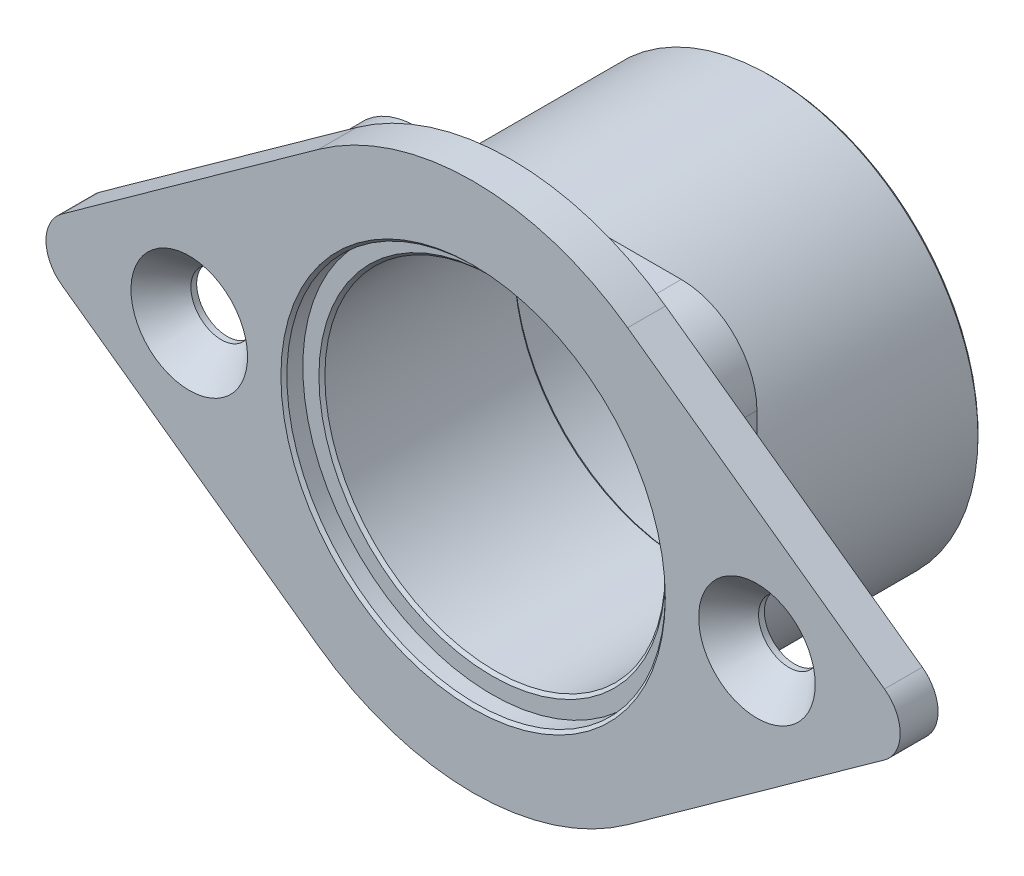
ISO-10303-21;
HEADER;
FILE_DESCRIPTION(('STEP AP214'),'2;1');
FILE_NAME('part.step','',(''),(''),'','','');
FILE_SCHEMA(('AUTOMOTIVE_DESIGN { 1 0 10303 214 1 1 1 1 }'));
ENDSEC;
DATA;
#1=APPLICATION_CONTEXT('core data for automotive mechanical design processes');
#2=APPLICATION_PROTOCOL_DEFINITION('international standard','automotive_design',2000,#1);
#3=PRODUCT_CONTEXT('',#1,'mechanical');
#4=PRODUCT('Part','Part','',(#3));
#5=PRODUCT_RELATED_PRODUCT_CATEGORY('part','',(#4));
#6=PRODUCT_DEFINITION_FORMATION('','',#4);
#7=PRODUCT_DEFINITION_CONTEXT('part definition',#1,'design');
#8=PRODUCT_DEFINITION('design','',#6,#7);
#9=PRODUCT_DEFINITION_SHAPE('','',#8);
#10=(LENGTH_UNIT() NAMED_UNIT(*) SI_UNIT(.MILLI.,.METRE.));
#11=(NAMED_UNIT(*) PLANE_ANGLE_UNIT() SI_UNIT($,.RADIAN.));
#12=(NAMED_UNIT(*) SI_UNIT($,.STERADIAN.) SOLID_ANGLE_UNIT());
#13=UNCERTAINTY_MEASURE_WITH_UNIT(LENGTH_MEASURE(1.E-05),#10,'distance_accuracy_value','');
#14=(GEOMETRIC_REPRESENTATION_CONTEXT(3) GLOBAL_UNCERTAINTY_ASSIGNED_CONTEXT((#13)) GLOBAL_UNIT_ASSIGNED_CONTEXT((#10,
#11,#12)) REPRESENTATION_CONTEXT('',''));
#15=CARTESIAN_POINT('',(0.,0.,0.));
#16=DIRECTION('',(0.,0.,1.));
#17=DIRECTION('',(1.,0.,0.));
#18=AXIS2_PLACEMENT_3D('',#15,#16,#17);
#19=CARTESIAN_POINT('',(0.,0.,0.));
#20=DIRECTION('',(0.,0.,1.));
#21=DIRECTION('',(1.,0.,0.));
#22=AXIS2_PLACEMENT_3D('',#19,#20,#21);
#23=CONICAL_SURFACE('',#22,14.5248,0.785398163397445);
#24=CARTESIAN_POINT('',(0.,0.,-0.249999999999999));
#25=DIRECTION('',(0.,0.,-1.));
#26=DIRECTION('',(-1.,0.,0.));
#27=AXIS2_PLACEMENT_3D('',#24,#25,#26);
#28=CIRCLE('',#27,14.2748);
#29=CARTESIAN_POINT('',(-14.2748,0.,-0.249999999999999));
#30=VERTEX_POINT('',#29);
#31=EDGE_CURVE('E184',#30,#30,#28,.T.);
#32=ORIENTED_EDGE('',*,*,#31,.T.);
#33=EDGE_LOOP('',(#32));
#34=FACE_BOUND('',#33,.T.);
#35=CARTESIAN_POINT('',(0.,0.,0.));
#36=DIRECTION('',(0.,0.,1.));
#37=DIRECTION('',(1.,0.,0.));
#38=AXIS2_PLACEMENT_3D('',#35,#36,#37);
#39=CIRCLE('',#38,14.5248);
#40=CARTESIAN_POINT('',(14.5248,0.,0.));
#41=VERTEX_POINT('',#40);
#42=EDGE_CURVE('E19',#41,#41,#39,.F.);
#43=ORIENTED_EDGE('',*,*,#42,.F.);
#44=EDGE_LOOP('',(#43));
#45=FACE_BOUND('',#44,.T.);
#46=ADVANCED_FACE('F16',(#34,#45),#23,.F.);
#47=CARTESIAN_POINT('',(0.,0.,0.));
#48=DIRECTION('',(0.,0.,1.));
#49=DIRECTION('',(1.,0.,0.));
#50=AXIS2_PLACEMENT_3D('',#47,#48,#49);
#51=PLANE('',#50);
#52=CARTESIAN_POINT('',(0.,0.,0.));
#53=DIRECTION('',(0.,0.,1.));
#54=DIRECTION('',(1.,0.,0.));
#55=AXIS2_PLACEMENT_3D('',#52,#53,#54);
#56=CIRCLE('',#55,15.875);
#57=CARTESIAN_POINT('',(15.875,0.,0.));
#58=VERTEX_POINT('',#57);
#59=EDGE_CURVE('E183',#58,#58,#56,.T.);
#60=ORIENTED_EDGE('',*,*,#59,.T.);
#61=EDGE_LOOP('',(#60));
#62=FACE_BOUND('',#61,.T.);
#63=ORIENTED_EDGE('',*,*,#42,.T.);
#64=EDGE_LOOP('',(#63));
#65=FACE_BOUND('',#64,.T.);
#66=ADVANCED_FACE('F278',(#62,#65),#51,.T.);
#67=CARTESIAN_POINT('',(0.,0.,1.5875));
#68=DIRECTION('',(0.,0.,-1.));
#69=DIRECTION('',(-1.,0.,0.));
#70=AXIS2_PLACEMENT_3D('',#67,#68,#69);
#71=CYLINDRICAL_SURFACE('',#70,14.2748);
#72=ORIENTED_EDGE('',*,*,#31,.F.);
#73=EDGE_LOOP('',(#72));
#74=FACE_BOUND('',#73,.T.);
#75=CARTESIAN_POINT('',(0.,0.,-16.16475));
#76=DIRECTION('',(0.,0.,-1.));
#77=DIRECTION('',(-1.,0.,0.));
#78=AXIS2_PLACEMENT_3D('',#75,#76,#77);
#79=CIRCLE('',#78,14.2748);
#80=CARTESIAN_POINT('',(-14.2748,0.,-16.16475));
#81=VERTEX_POINT('',#80);
#82=EDGE_CURVE('E180',#81,#81,#79,.T.);
#83=ORIENTED_EDGE('',*,*,#82,.T.);
#84=EDGE_LOOP('',(#83));
#85=FACE_BOUND('',#84,.T.);
#86=ADVANCED_FACE('F285',(#74,#85),#71,.F.);
#87=CARTESIAN_POINT('',(0.,0.,0.));
#88=DIRECTION('',(0.,0.,1.));
#89=DIRECTION('',(1.,0.,0.));
#90=AXIS2_PLACEMENT_3D('',#87,#88,#89);
#91=CYLINDRICAL_SURFACE('',#90,15.875);
#92=ORIENTED_EDGE('',*,*,#59,.F.);
#93=EDGE_LOOP('',(#92));
#94=FACE_BOUND('',#93,.T.);
#95=CARTESIAN_POINT('',(0.,0.,1.3375));
#96=DIRECTION('',(0.,0.,1.));
#97=DIRECTION('',(1.,0.,0.));
#98=AXIS2_PLACEMENT_3D('',#95,#96,#97);
#99=CIRCLE('',#98,15.875);
#100=CARTESIAN_POINT('',(15.875,0.,1.3375));
#101=VERTEX_POINT('',#100);
#102=EDGE_CURVE('E176',#101,#101,#99,.T.);
#103=ORIENTED_EDGE('',*,*,#102,.T.);
#104=EDGE_LOOP('',(#103));
#105=FACE_BOUND('',#104,.T.);
#106=ADVANCED_FACE('F281',(#94,#105),#91,.F.);
#107=CARTESIAN_POINT('',(0.,0.,-16.41475));
#108=DIRECTION('',(0.,0.,-1.));
#109=DIRECTION('',(-1.,0.,0.));
#110=AXIS2_PLACEMENT_3D('',#107,#108,#109);
#111=CONICAL_SURFACE('',#110,14.5248,0.785398163397452);
#112=ORIENTED_EDGE('',*,*,#82,.F.);
#113=EDGE_LOOP('',(#112));
#114=FACE_BOUND('',#113,.T.);
#115=CARTESIAN_POINT('',(0.,0.,-16.41475));
#116=DIRECTION('',(0.,0.,-1.));
#117=DIRECTION('',(-1.,0.,0.));
#118=AXIS2_PLACEMENT_3D('',#115,#116,#117);
#119=CIRCLE('',#118,14.5248);
#120=CARTESIAN_POINT('',(-14.5248,0.,-16.41475));
#121=VERTEX_POINT('',#120);
#122=EDGE_CURVE('E179',#121,#121,#119,.F.);
#123=ORIENTED_EDGE('',*,*,#122,.F.);
#124=EDGE_LOOP('',(#123));
#125=FACE_BOUND('',#124,.T.);
#126=ADVANCED_FACE('F284',(#114,#125),#111,.F.);
#127=CARTESIAN_POINT('',(0.,0.,1.5875));
#128=DIRECTION('',(0.,0.,1.));
#129=DIRECTION('',(1.,0.,0.));
#130=AXIS2_PLACEMENT_3D('',#127,#128,#129);
#131=CONICAL_SURFACE('',#130,16.125,0.785398163397434);
#132=ORIENTED_EDGE('',*,*,#102,.F.);
#133=EDGE_LOOP('',(#132));
#134=FACE_BOUND('',#133,.T.);
#135=CARTESIAN_POINT('',(0.,0.,1.5875));
#136=DIRECTION('',(0.,0.,1.));
#137=DIRECTION('',(1.,0.,0.));
#138=AXIS2_PLACEMENT_3D('',#135,#136,#137);
#139=CIRCLE('',#138,16.125);
#140=CARTESIAN_POINT('',(16.125,0.,1.5875));
#141=VERTEX_POINT('',#140);
#142=EDGE_CURVE('E271',#141,#141,#139,.F.);
#143=ORIENTED_EDGE('',*,*,#142,.F.);
#144=EDGE_LOOP('',(#143));
#145=FACE_BOUND('',#144,.T.);
#146=ADVANCED_FACE('F289',(#134,#145),#131,.F.);
#147=CARTESIAN_POINT('',(0.,0.,-16.41475));
#148=DIRECTION('',(0.,0.,-1.));
#149=DIRECTION('',(-1.,0.,0.));
#150=AXIS2_PLACEMENT_3D('',#147,#148,#149);
#151=PLANE('',#150);
#152=CARTESIAN_POINT('',(0.,0.,-16.41475));
#153=DIRECTION('',(0.,0.,-1.));
#154=DIRECTION('',(-1.,0.,0.));
#155=AXIS2_PLACEMENT_3D('',#152,#153,#154);
#156=CIRCLE('',#155,15.86865);
#157=CARTESIAN_POINT('',(-15.86865,0.,-16.41475));
#158=VERTEX_POINT('',#157);
#159=EDGE_CURVE('E175',#158,#158,#156,.T.);
#160=ORIENTED_EDGE('',*,*,#159,.T.);
#161=EDGE_LOOP('',(#160));
#162=FACE_BOUND('',#161,.T.);
#163=ORIENTED_EDGE('',*,*,#122,.T.);
#164=EDGE_LOOP('',(#163));
#165=FACE_BOUND('',#164,.T.);
#166=ADVANCED_FACE('F292',(#162,#165),#151,.T.);
#167=CARTESIAN_POINT('',(-23.8125,0.,1.58749999997099));
#168=DIRECTION('',(0.,0.,1.));
#169=DIRECTION('',(0.,-1.,0.));
#170=AXIS2_PLACEMENT_3D('',#167,#168,#169);
#171=CONICAL_SURFACE('',#170,4.88949999991382,0.715584993310947);
#172=CARTESIAN_POINT('',(-23.8125,0.,-1.10068089399405));
#173=DIRECTION('',(0.,0.,1.));
#174=DIRECTION('',(1.,0.,0.));
#175=AXIS2_PLACEMENT_3D('',#172,#173,#174);
#176=CIRCLE('',#175,2.5527);
#177=CARTESIAN_POINT('',(-21.2598,0.,-1.10068089399405));
#178=VERTEX_POINT('',#177);
#179=EDGE_CURVE('E172',#178,#178,#176,.F.);
#180=ORIENTED_EDGE('',*,*,#179,.T.);
#181=EDGE_LOOP('',(#180));
#182=FACE_BOUND('',#181,.T.);
#183=CARTESIAN_POINT('',(-23.8125,0.,1.58749999997099));
#184=DIRECTION('',(0.,0.,1.));
#185=DIRECTION('',(0.,-1.,0.));
#186=AXIS2_PLACEMENT_3D('',#183,#184,#185);
#187=CIRCLE('',#186,4.88949999991382);
#188=CARTESIAN_POINT('',(-23.8125,-4.88949999991382,1.58749999997099));
#189=VERTEX_POINT('',#188);
#190=EDGE_CURVE('E268',#189,#189,#187,.F.);
#191=ORIENTED_EDGE('',*,*,#190,.F.);
#192=EDGE_LOOP('',(#191));
#193=FACE_BOUND('',#192,.T.);
#194=ADVANCED_FACE('F308',(#182,#193),#171,.F.);
#195=CARTESIAN_POINT('',(23.8125,0.,1.58750000008467));
#196=DIRECTION('',(0.,0.,1.));
#197=DIRECTION('',(1.,0.,0.));
#198=AXIS2_PLACEMENT_3D('',#195,#196,#197);
#199=CONICAL_SURFACE('',#198,4.88950000000978,0.715584993314095);
#200=CARTESIAN_POINT('',(23.8125,0.,-1.10068089399405));
#201=DIRECTION('',(0.,0.,1.));
#202=DIRECTION('',(1.,0.,0.));
#203=AXIS2_PLACEMENT_3D('',#200,#201,#202);
#204=CIRCLE('',#203,2.5527);
#205=CARTESIAN_POINT('',(26.3652,0.,-1.10068089399405));
#206=VERTEX_POINT('',#205);
#207=EDGE_CURVE('E150',#206,#206,#204,.F.);
#208=ORIENTED_EDGE('',*,*,#207,.T.);
#209=EDGE_LOOP('',(#208));
#210=FACE_BOUND('',#209,.T.);
#211=CARTESIAN_POINT('',(23.8125,0.,1.58750000008467));
#212=DIRECTION('',(0.,0.,1.));
#213=DIRECTION('',(1.,0.,0.));
#214=AXIS2_PLACEMENT_3D('',#211,#212,#213);
#215=CIRCLE('',#214,4.88950000000978);
#216=CARTESIAN_POINT('',(28.7020000000098,0.,1.58750000008467));
#217=VERTEX_POINT('',#216);
#218=EDGE_CURVE('E265',#217,#217,#215,.F.);
#219=ORIENTED_EDGE('',*,*,#218,.F.);
#220=EDGE_LOOP('',(#219));
#221=FACE_BOUND('',#220,.T.);
#222=ADVANCED_FACE('F298',(#210,#221),#199,.F.);
#223=CARTESIAN_POINT('',(0.,0.,1.5875));
#224=DIRECTION('',(0.,0.,1.));
#225=DIRECTION('',(1.,0.,0.));
#226=AXIS2_PLACEMENT_3D('',#223,#224,#225);
#227=PLANE('',#226);
#228=DIRECTION('',(-0.812232862067414,0.583333333333333,0.));
#229=VECTOR('',#228,1.);
#230=CARTESIAN_POINT('',(-12.9645833333333,-18.0518753594483,1.5875));
#231=LINE('',#230,#229);
#232=CARTESIAN_POINT('',(-34.5092261904762,-2.57883933706404,1.5875));
#233=VERTEX_POINT('',#232);
#234=CARTESIAN_POINT('',(-12.9645833333333,-18.0518753594483,1.5875));
#235=VERTEX_POINT('',#234);
#236=EDGE_CURVE('E168',#233,#235,#231,.F.);
#237=ORIENTED_EDGE('',*,*,#236,.T.);
#238=CARTESIAN_POINT('',(0.,0.,1.5875));
#239=DIRECTION('',(0.,0.,-1.));
#240=DIRECTION('',(-1.,0.,0.));
#241=AXIS2_PLACEMENT_3D('',#238,#239,#240);
#242=CIRCLE('',#241,22.225);
#243=CARTESIAN_POINT('',(12.9645833333333,-18.0518753594483,1.5875));
#244=VERTEX_POINT('',#243);
#245=EDGE_CURVE('E257',#244,#235,#242,.T.);
#246=ORIENTED_EDGE('',*,*,#245,.F.);
#247=DIRECTION('',(0.812232862067414,0.583333333333333,0.));
#248=VECTOR('',#247,1.);
#249=CARTESIAN_POINT('',(12.9645833333333,-18.0518753594483,1.5875));
#250=LINE('',#249,#248);
#251=CARTESIAN_POINT('',(34.5092261904762,-2.57883933706403,1.5875));
#252=VERTEX_POINT('',#251);
#253=EDGE_CURVE('E686',#252,#244,#250,.F.);
#254=ORIENTED_EDGE('',*,*,#253,.F.);
#255=CARTESIAN_POINT('',(32.6571428571429,0.,1.5875));
#256=DIRECTION('',(0.,0.,-1.));
#257=DIRECTION('',(-1.,0.,0.));
#258=AXIS2_PLACEMENT_3D('',#255,#256,#257);
#259=CIRCLE('',#258,3.175);
#260=CARTESIAN_POINT('',(34.5092261904762,2.57883933706404,1.5875));
#261=VERTEX_POINT('',#260);
#262=EDGE_CURVE('E252',#261,#252,#259,.T.);
#263=ORIENTED_EDGE('',*,*,#262,.F.);
#264=DIRECTION('',(-0.812232862067414,0.583333333333333,0.));
#265=VECTOR('',#264,1.);
#266=CARTESIAN_POINT('',(12.9645833333333,18.0518753594483,1.5875));
#267=LINE('',#266,#265);
#268=CARTESIAN_POINT('',(12.9645833333333,18.0518753594483,1.5875));
#269=VERTEX_POINT('',#268);
#270=EDGE_CURVE('E146',#269,#261,#267,.F.);
#271=ORIENTED_EDGE('',*,*,#270,.F.);
#272=CARTESIAN_POINT('',(0.,0.,1.5875));
#273=DIRECTION('',(0.,0.,-1.));
#274=DIRECTION('',(-1.,0.,0.));
#275=AXIS2_PLACEMENT_3D('',#272,#273,#274);
#276=CIRCLE('',#275,22.225);
#277=CARTESIAN_POINT('',(-12.9645833333333,18.0518753594483,1.5875));
#278=VERTEX_POINT('',#277);
#279=EDGE_CURVE('E138',#278,#269,#276,.T.);
#280=ORIENTED_EDGE('',*,*,#279,.F.);
#281=DIRECTION('',(0.812232862067414,0.583333333333333,0.));
#282=VECTOR('',#281,1.);
#283=CARTESIAN_POINT('',(-12.9645833333333,18.0518753594483,1.5875));
#284=LINE('',#283,#282);
#285=CARTESIAN_POINT('',(-34.5092261904762,2.57883933706403,1.5875));
#286=VERTEX_POINT('',#285);
#287=EDGE_CURVE('E143',#278,#286,#284,.F.);
#288=ORIENTED_EDGE('',*,*,#287,.T.);
#289=CARTESIAN_POINT('',(-32.6571428571429,0.,1.5875));
#290=DIRECTION('',(0.,0.,-1.));
#291=DIRECTION('',(-1.,0.,0.));
#292=AXIS2_PLACEMENT_3D('',#289,#290,#291);
#293=CIRCLE('',#292,3.175);
#294=EDGE_CURVE('E164',#233,#286,#293,.T.);
#295=ORIENTED_EDGE('',*,*,#294,.F.);
#296=EDGE_LOOP('',(#237,#246,#254,#263,#271,#280,#288,#295));
#297=FACE_BOUND('',#296,.T.);
#298=ORIENTED_EDGE('',*,*,#218,.T.);
#299=EDGE_LOOP('',(#298));
#300=FACE_BOUND('',#299,.T.);
#301=ORIENTED_EDGE('',*,*,#190,.T.);
#302=EDGE_LOOP('',(#301));
#303=FACE_BOUND('',#302,.T.);
#304=ORIENTED_EDGE('',*,*,#142,.T.);
#305=EDGE_LOOP('',(#304));
#306=FACE_BOUND('',#305,.T.);
#307=ADVANCED_FACE('F140',(#297,#300,#303,#306),#227,.T.);
#308=CARTESIAN_POINT('',(0.,0.,-16.41475));
#309=DIRECTION('',(0.,0.,-1.));
#310=DIRECTION('',(-1.,0.,0.));
#311=AXIS2_PLACEMENT_3D('',#308,#309,#310);
#312=CYLINDRICAL_SURFACE('',#311,15.86865);
#313=ORIENTED_EDGE('',*,*,#159,.F.);
#314=EDGE_LOOP('',(#313));
#315=FACE_BOUND('',#314,.T.);
#316=CARTESIAN_POINT('',(0.,0.,-23.3085));
#317=DIRECTION('',(0.,0.,-1.));
#318=DIRECTION('',(-1.,0.,0.));
#319=AXIS2_PLACEMENT_3D('',#316,#317,#318);
#320=CIRCLE('',#319,15.86865);
#321=CARTESIAN_POINT('',(-15.86865,0.,-23.3085));
#322=VERTEX_POINT('',#321);
#323=EDGE_CURVE('E251',#322,#322,#320,.T.);
#324=ORIENTED_EDGE('',*,*,#323,.T.);
#325=EDGE_LOOP('',(#324));
#326=FACE_BOUND('',#325,.T.);
#327=ADVANCED_FACE('F297',(#315,#326),#312,.F.);
#328=CARTESIAN_POINT('',(-23.8125,0.,1.5875));
#329=DIRECTION('',(0.,0.,1.));
#330=DIRECTION('',(1.,0.,0.));
#331=AXIS2_PLACEMENT_3D('',#328,#329,#330);
#332=CYLINDRICAL_SURFACE('',#331,2.5527);
#333=CARTESIAN_POINT('',(-23.8125,0.,-1.5875));
#334=DIRECTION('',(0.,0.,1.));
#335=DIRECTION('',(1.,0.,0.));
#336=AXIS2_PLACEMENT_3D('',#333,#334,#335);
#337=CIRCLE('',#336,2.5527);
#338=CARTESIAN_POINT('',(-21.2598,0.,-1.5875));
#339=VERTEX_POINT('',#338);
#340=EDGE_CURVE('E248',#339,#339,#337,.F.);
#341=ORIENTED_EDGE('',*,*,#340,.T.);
#342=EDGE_LOOP('',(#341));
#343=FACE_BOUND('',#342,.T.);
#344=ORIENTED_EDGE('',*,*,#179,.F.);
#345=EDGE_LOOP('',(#344));
#346=FACE_BOUND('',#345,.T.);
#347=ADVANCED_FACE('F305',(#343,#346),#332,.F.);
#348=CARTESIAN_POINT('',(23.8125,0.,1.5875));
#349=DIRECTION('',(0.,0.,1.));
#350=DIRECTION('',(1.,0.,0.));
#351=AXIS2_PLACEMENT_3D('',#348,#349,#350);
#352=CYLINDRICAL_SURFACE('',#351,2.5527);
#353=CARTESIAN_POINT('',(23.8125,0.,-1.5875));
#354=DIRECTION('',(0.,0.,1.));
#355=DIRECTION('',(1.,0.,0.));
#356=AXIS2_PLACEMENT_3D('',#353,#354,#355);
#357=CIRCLE('',#356,2.5527);
#358=CARTESIAN_POINT('',(26.3652,0.,-1.5875));
#359=VERTEX_POINT('',#358);
#360=EDGE_CURVE('E245',#359,#359,#357,.F.);
#361=ORIENTED_EDGE('',*,*,#360,.T.);
#362=EDGE_LOOP('',(#361));
#363=FACE_BOUND('',#362,.T.);
#364=ORIENTED_EDGE('',*,*,#207,.F.);
#365=EDGE_LOOP('',(#364));
#366=FACE_BOUND('',#365,.T.);
#367=ADVANCED_FACE('F410',(#363,#366),#352,.F.);
#368=CARTESIAN_POINT('',(0.,0.,1.5875));
#369=DIRECTION('',(0.,0.,-1.));
#370=DIRECTION('',(-1.,0.,0.));
#371=AXIS2_PLACEMENT_3D('',#368,#369,#370);
#372=CYLINDRICAL_SURFACE('',#371,22.225);
#373=ORIENTED_EDGE('',*,*,#279,.T.);
#374=DIRECTION('',(0.,0.,1.));
#375=VECTOR('',#374,1.);
#376=CARTESIAN_POINT('',(12.9645833333333,18.0518753594483,1.5875));
#377=LINE('',#376,#375);
#378=CARTESIAN_POINT('',(12.9645833333333,18.0518753594483,-1.5875));
#379=VERTEX_POINT('',#378);
#380=EDGE_CURVE('E681',#379,#269,#377,.T.);
#381=ORIENTED_EDGE('',*,*,#380,.F.);
#382=CARTESIAN_POINT('',(0.,0.,-1.5875));
#383=DIRECTION('',(0.,0.,-1.));
#384=DIRECTION('',(-1.,0.,0.));
#385=AXIS2_PLACEMENT_3D('',#382,#383,#384);
#386=CIRCLE('',#385,22.225);
#387=CARTESIAN_POINT('',(-12.9645833333333,18.0518753594483,-1.5875));
#388=VERTEX_POINT('',#387);
#389=EDGE_CURVE('E155',#379,#388,#386,.F.);
#390=ORIENTED_EDGE('',*,*,#389,.T.);
#391=DIRECTION('',(0.,0.,1.));
#392=VECTOR('',#391,1.);
#393=CARTESIAN_POINT('',(-12.9645833333333,18.0518753594483,1.5875));
#394=LINE('',#393,#392);
#395=EDGE_CURVE('E149',#388,#278,#394,.T.);
#396=ORIENTED_EDGE('',*,*,#395,.T.);
#397=EDGE_LOOP('',(#373,#381,#390,#396));
#398=FACE_BOUND('',#397,.T.);
#399=ADVANCED_FACE('F153',(#398),#372,.T.);
#400=CARTESIAN_POINT('',(-12.9645833333333,18.0518753594483,1.5875));
#401=DIRECTION('',(0.583333333333333,-0.812232862067414,0.));
#402=DIRECTION('',(0.812232862067414,0.583333333333333,0.));
#403=AXIS2_PLACEMENT_3D('',#400,#401,#402);
#404=PLANE('',#403);
#405=DIRECTION('',(0.,0.,-1.));
#406=VECTOR('',#405,1.);
#407=CARTESIAN_POINT('',(-34.5092261904762,2.57883933706403,1.5875));
#408=LINE('',#407,#406);
#409=CARTESIAN_POINT('',(-34.5092261904762,2.57883933706403,-1.5875));
#410=VERTEX_POINT('',#409);
#411=EDGE_CURVE('E162',#286,#410,#408,.T.);
#412=ORIENTED_EDGE('',*,*,#411,.F.);
#413=ORIENTED_EDGE('',*,*,#287,.F.);
#414=ORIENTED_EDGE('',*,*,#395,.F.);
#415=DIRECTION('',(-0.812232862067414,-0.583333333333333,0.));
#416=VECTOR('',#415,1.);
#417=CARTESIAN_POINT('',(-12.9645833333333,18.0518753594483,-1.5875));
#418=LINE('',#417,#416);
#419=EDGE_CURVE('E243',#388,#410,#418,.T.);
#420=ORIENTED_EDGE('',*,*,#419,.T.);
#421=EDGE_LOOP('',(#412,#413,#414,#420));
#422=FACE_BOUND('',#421,.T.);
#423=ADVANCED_FACE('F160',(#422),#404,.F.);
#424=CARTESIAN_POINT('',(-32.6571428571429,0.,1.5875));
#425=DIRECTION('',(0.,0.,-1.));
#426=DIRECTION('',(-1.,0.,0.));
#427=AXIS2_PLACEMENT_3D('',#424,#425,#426);
#428=CYLINDRICAL_SURFACE('',#427,3.175);
#429=CARTESIAN_POINT('',(-32.6571428571429,0.,-1.5875));
#430=DIRECTION('',(0.,0.,-1.));
#431=DIRECTION('',(-1.,0.,0.));
#432=AXIS2_PLACEMENT_3D('',#429,#430,#431);
#433=CIRCLE('',#432,3.175);
#434=CARTESIAN_POINT('',(-34.5092261904762,-2.57883933706404,-1.5875));
#435=VERTEX_POINT('',#434);
#436=EDGE_CURVE('E241',#410,#435,#433,.F.);
#437=ORIENTED_EDGE('',*,*,#436,.T.);
#438=DIRECTION('',(0.,0.,1.));
#439=VECTOR('',#438,1.);
#440=CARTESIAN_POINT('',(-34.5092261904762,-2.57883933706404,1.5875));
#441=LINE('',#440,#439);
#442=EDGE_CURVE('E261',#435,#233,#441,.T.);
#443=ORIENTED_EDGE('',*,*,#442,.T.);
#444=ORIENTED_EDGE('',*,*,#294,.T.);
#445=ORIENTED_EDGE('',*,*,#411,.T.);
#446=EDGE_LOOP('',(#437,#443,#444,#445));
#447=FACE_BOUND('',#446,.T.);
#448=ADVANCED_FACE('F401',(#447),#428,.T.);
#449=CARTESIAN_POINT('',(-12.9645833333333,-18.0518753594483,1.5875));
#450=DIRECTION('',(0.583333333333333,0.812232862067414,0.));
#451=DIRECTION('',(-0.812232862067414,0.583333333333333,0.));
#452=AXIS2_PLACEMENT_3D('',#449,#450,#451);
#453=PLANE('',#452);
#454=ORIENTED_EDGE('',*,*,#442,.F.);
#455=DIRECTION('',(0.812232862067414,-0.583333333333333,0.));
#456=VECTOR('',#455,1.);
#457=CARTESIAN_POINT('',(-34.5092261904762,-2.57883933706404,-1.5875));
#458=LINE('',#457,#456);
#459=CARTESIAN_POINT('',(-12.9645833333333,-18.0518753594483,-1.5875));
#460=VERTEX_POINT('',#459);
#461=EDGE_CURVE('E240',#435,#460,#458,.T.);
#462=ORIENTED_EDGE('',*,*,#461,.T.);
#463=DIRECTION('',(0.,0.,-1.));
#464=VECTOR('',#463,1.);
#465=CARTESIAN_POINT('',(-12.9645833333333,-18.0518753594483,1.5875));
#466=LINE('',#465,#464);
#467=EDGE_CURVE('E260',#235,#460,#466,.T.);
#468=ORIENTED_EDGE('',*,*,#467,.F.);
#469=ORIENTED_EDGE('',*,*,#236,.F.);
#470=EDGE_LOOP('',(#454,#462,#468,#469));
#471=FACE_BOUND('',#470,.T.);
#472=ADVANCED_FACE('F397',(#471),#453,.F.);
#473=CARTESIAN_POINT('',(0.,0.,1.5875));
#474=DIRECTION('',(0.,0.,-1.));
#475=DIRECTION('',(-1.,0.,0.));
#476=AXIS2_PLACEMENT_3D('',#473,#474,#475);
#477=CYLINDRICAL_SURFACE('',#476,22.225);
#478=ORIENTED_EDGE('',*,*,#245,.T.);
#479=ORIENTED_EDGE('',*,*,#467,.T.);
#480=CARTESIAN_POINT('',(0.,0.,-1.5875));
#481=DIRECTION('',(0.,0.,-1.));
#482=DIRECTION('',(-1.,0.,0.));
#483=AXIS2_PLACEMENT_3D('',#480,#481,#482);
#484=CIRCLE('',#483,22.225);
#485=CARTESIAN_POINT('',(12.9645833333333,-18.0518753594483,-1.5875));
#486=VERTEX_POINT('',#485);
#487=EDGE_CURVE('E238',#460,#486,#484,.F.);
#488=ORIENTED_EDGE('',*,*,#487,.T.);
#489=DIRECTION('',(0.,0.,1.));
#490=VECTOR('',#489,1.);
#491=CARTESIAN_POINT('',(12.9645833333333,-18.0518753594483,1.5875));
#492=LINE('',#491,#490);
#493=EDGE_CURVE('E256',#244,#486,#492,.F.);
#494=ORIENTED_EDGE('',*,*,#493,.F.);
#495=EDGE_LOOP('',(#478,#479,#488,#494));
#496=FACE_BOUND('',#495,.T.);
#497=ADVANCED_FACE('F393',(#496),#477,.T.);
#498=CARTESIAN_POINT('',(12.9645833333333,-18.0518753594483,1.5875));
#499=DIRECTION('',(0.583333333333333,-0.812232862067414,0.));
#500=DIRECTION('',(0.812232862067414,0.583333333333333,0.));
#501=AXIS2_PLACEMENT_3D('',#498,#499,#500);
#502=PLANE('',#501);
#503=ORIENTED_EDGE('',*,*,#253,.T.);
#504=ORIENTED_EDGE('',*,*,#493,.T.);
#505=DIRECTION('',(0.812232862067413,0.583333333333333,0.));
#506=VECTOR('',#505,1.);
#507=CARTESIAN_POINT('',(12.9645833333333,-18.0518753594483,-1.5875));
#508=LINE('',#507,#506);
#509=CARTESIAN_POINT('',(34.5092261904762,-2.57883933706403,-1.5875));
#510=VERTEX_POINT('',#509);
#511=EDGE_CURVE('E237',#486,#510,#508,.T.);
#512=ORIENTED_EDGE('',*,*,#511,.T.);
#513=DIRECTION('',(0.,0.,-1.));
#514=VECTOR('',#513,1.);
#515=CARTESIAN_POINT('',(34.5092261904762,-2.57883933706403,1.5875));
#516=LINE('',#515,#514);
#517=EDGE_CURVE('E255',#252,#510,#516,.T.);
#518=ORIENTED_EDGE('',*,*,#517,.F.);
#519=EDGE_LOOP('',(#503,#504,#512,#518));
#520=FACE_BOUND('',#519,.T.);
#521=ADVANCED_FACE('F389',(#520),#502,.T.);
#522=CARTESIAN_POINT('',(32.6571428571429,0.,1.5875));
#523=DIRECTION('',(0.,0.,-1.));
#524=DIRECTION('',(-1.,0.,0.));
#525=AXIS2_PLACEMENT_3D('',#522,#523,#524);
#526=CYLINDRICAL_SURFACE('',#525,3.175);
#527=CARTESIAN_POINT('',(32.6571428571429,0.,-1.5875));
#528=DIRECTION('',(0.,0.,-1.));
#529=DIRECTION('',(-1.,0.,0.));
#530=AXIS2_PLACEMENT_3D('',#527,#528,#529);
#531=CIRCLE('',#530,3.175);
#532=CARTESIAN_POINT('',(34.5092261904762,2.57883933706404,-1.5875));
#533=VERTEX_POINT('',#532);
#534=EDGE_CURVE('E235',#510,#533,#531,.F.);
#535=ORIENTED_EDGE('',*,*,#534,.T.);
#536=DIRECTION('',(0.,0.,1.));
#537=VECTOR('',#536,1.);
#538=CARTESIAN_POINT('',(34.5092261904762,2.57883933706404,1.5875));
#539=LINE('',#538,#537);
#540=EDGE_CURVE('E683',#261,#533,#539,.F.);
#541=ORIENTED_EDGE('',*,*,#540,.F.);
#542=ORIENTED_EDGE('',*,*,#262,.T.);
#543=ORIENTED_EDGE('',*,*,#517,.T.);
#544=EDGE_LOOP('',(#535,#541,#542,#543));
#545=FACE_BOUND('',#544,.T.);
#546=ADVANCED_FACE('F385',(#545),#526,.T.);
#547=CARTESIAN_POINT('',(12.9645833333333,18.0518753594483,1.5875));
#548=DIRECTION('',(0.583333333333333,0.812232862067414,0.));
#549=DIRECTION('',(-0.812232862067414,0.583333333333333,0.));
#550=AXIS2_PLACEMENT_3D('',#547,#548,#549);
#551=PLANE('',#550);
#552=DIRECTION('',(-0.812232862067414,0.583333333333333,0.));
#553=VECTOR('',#552,1.);
#554=CARTESIAN_POINT('',(34.5092261904762,2.57883933706404,-1.5875));
#555=LINE('',#554,#553);
#556=EDGE_CURVE('E234',#533,#379,#555,.T.);
#557=ORIENTED_EDGE('',*,*,#556,.T.);
#558=ORIENTED_EDGE('',*,*,#380,.T.);
#559=ORIENTED_EDGE('',*,*,#270,.T.);
#560=ORIENTED_EDGE('',*,*,#540,.T.);
#561=EDGE_LOOP('',(#557,#558,#559,#560));
#562=FACE_BOUND('',#561,.T.);
#563=ADVANCED_FACE('F381',(#562),#551,.T.);
#564=CARTESIAN_POINT('',(0.,0.,-23.5585));
#565=DIRECTION('',(0.,0.,-1.));
#566=DIRECTION('',(-1.,0.,0.));
#567=AXIS2_PLACEMENT_3D('',#564,#565,#566);
#568=CONICAL_SURFACE('',#567,16.11865,0.785398163397462);
#569=ORIENTED_EDGE('',*,*,#323,.F.);
#570=EDGE_LOOP('',(#569));
#571=FACE_BOUND('',#570,.T.);
#572=CARTESIAN_POINT('',(0.,0.,-23.5585));
#573=DIRECTION('',(0.,0.,-1.));
#574=DIRECTION('',(-1.,0.,0.));
#575=AXIS2_PLACEMENT_3D('',#572,#573,#574);
#576=CIRCLE('',#575,16.11865);
#577=CARTESIAN_POINT('',(-16.11865,0.,-23.5585));
#578=VERTEX_POINT('',#577);
#579=EDGE_CURVE('E223',#578,#578,#576,.F.);
#580=ORIENTED_EDGE('',*,*,#579,.F.);
#581=EDGE_LOOP('',(#580));
#582=FACE_BOUND('',#581,.T.);
#583=ADVANCED_FACE('F377',(#571,#582),#568,.F.);
#584=CARTESIAN_POINT('',(0.,0.,-1.5875));
#585=DIRECTION('',(0.,0.,1.));
#586=DIRECTION('',(1.,0.,0.));
#587=AXIS2_PLACEMENT_3D('',#584,#585,#586);
#588=PLANE('',#587);
#589=CARTESIAN_POINT('',(-11.1125,11.1125,-1.5875));
#590=DIRECTION('',(0.,0.,1.));
#591=DIRECTION('',(1.,0.,0.));
#592=AXIS2_PLACEMENT_3D('',#589,#590,#591);
#593=CIRCLE('',#592,6.35);
#594=CARTESIAN_POINT('',(-17.4625,11.1125,-1.5875));
#595=VERTEX_POINT('',#594);
#596=CARTESIAN_POINT('',(-11.1125,17.4625,-1.5875));
#597=VERTEX_POINT('',#596);
#598=EDGE_CURVE('E219',#595,#597,#593,.F.);
#599=ORIENTED_EDGE('',*,*,#598,.F.);
#600=DIRECTION('',(0.,1.,0.));
#601=VECTOR('',#600,1.);
#602=CARTESIAN_POINT('',(-17.4625,-17.4625,-1.5875));
#603=LINE('',#602,#601);
#604=CARTESIAN_POINT('',(-17.4625,-11.1125,-1.5875));
#605=VERTEX_POINT('',#604);
#606=EDGE_CURVE('E716',#595,#605,#603,.F.);
#607=ORIENTED_EDGE('',*,*,#606,.T.);
#608=CARTESIAN_POINT('',(-11.1125,-11.1125,-1.5875));
#609=DIRECTION('',(0.,0.,1.));
#610=DIRECTION('',(1.,0.,0.));
#611=AXIS2_PLACEMENT_3D('',#608,#609,#610);
#612=CIRCLE('',#611,6.35);
#613=CARTESIAN_POINT('',(-11.1125,-17.4625,-1.5875));
#614=VERTEX_POINT('',#613);
#615=EDGE_CURVE('E227',#614,#605,#612,.F.);
#616=ORIENTED_EDGE('',*,*,#615,.F.);
#617=DIRECTION('',(1.,0.,0.));
#618=VECTOR('',#617,1.);
#619=CARTESIAN_POINT('',(17.4625,-17.4625,-1.5875));
#620=LINE('',#619,#618);
#621=CARTESIAN_POINT('',(11.1125,-17.4625,-1.5875));
#622=VERTEX_POINT('',#621);
#623=EDGE_CURVE('E719',#614,#622,#620,.T.);
#624=ORIENTED_EDGE('',*,*,#623,.T.);
#625=CARTESIAN_POINT('',(11.1125,-11.1125,-1.5875));
#626=DIRECTION('',(0.,0.,1.));
#627=DIRECTION('',(1.,0.,0.));
#628=AXIS2_PLACEMENT_3D('',#625,#626,#627);
#629=CIRCLE('',#628,6.35);
#630=CARTESIAN_POINT('',(17.4625,-11.1125,-1.5875));
#631=VERTEX_POINT('',#630);
#632=EDGE_CURVE('E231',#631,#622,#629,.F.);
#633=ORIENTED_EDGE('',*,*,#632,.F.);
#634=DIRECTION('',(0.,1.,0.));
#635=VECTOR('',#634,1.);
#636=CARTESIAN_POINT('',(17.4625,-17.4625,-1.5875));
#637=LINE('',#636,#635);
#638=CARTESIAN_POINT('',(17.4625,11.1125,-1.5875));
#639=VERTEX_POINT('',#638);
#640=EDGE_CURVE('E218',#631,#639,#637,.T.);
#641=ORIENTED_EDGE('',*,*,#640,.T.);
#642=CARTESIAN_POINT('',(11.1125,11.1125,-1.5875));
#643=DIRECTION('',(0.,0.,1.));
#644=DIRECTION('',(1.,0.,0.));
#645=AXIS2_PLACEMENT_3D('',#642,#643,#644);
#646=CIRCLE('',#645,6.35);
#647=CARTESIAN_POINT('',(11.1125,17.4625,-1.5875));
#648=VERTEX_POINT('',#647);
#649=EDGE_CURVE('E214',#648,#639,#646,.F.);
#650=ORIENTED_EDGE('',*,*,#649,.F.);
#651=DIRECTION('',(1.,0.,0.));
#652=VECTOR('',#651,1.);
#653=CARTESIAN_POINT('',(17.4625,17.4625,-1.5875));
#654=LINE('',#653,#652);
#655=EDGE_CURVE('E735',#648,#597,#654,.F.);
#656=ORIENTED_EDGE('',*,*,#655,.T.);
#657=EDGE_LOOP('',(#599,#607,#616,#624,#633,#641,#650,#656));
#658=FACE_BOUND('',#657,.T.);
#659=ORIENTED_EDGE('',*,*,#534,.F.);
#660=ORIENTED_EDGE('',*,*,#511,.F.);
#661=ORIENTED_EDGE('',*,*,#487,.F.);
#662=ORIENTED_EDGE('',*,*,#461,.F.);
#663=ORIENTED_EDGE('',*,*,#436,.F.);
#664=ORIENTED_EDGE('',*,*,#419,.F.);
#665=ORIENTED_EDGE('',*,*,#389,.F.);
#666=ORIENTED_EDGE('',*,*,#556,.F.);
#667=EDGE_LOOP('',(#659,#660,#661,#662,#663,#664,#665,#666));
#668=FACE_BOUND('',#667,.T.);
#669=ORIENTED_EDGE('',*,*,#360,.F.);
#670=EDGE_LOOP('',(#669));
#671=FACE_BOUND('',#670,.T.);
#672=ORIENTED_EDGE('',*,*,#340,.F.);
#673=EDGE_LOOP('',(#672));
#674=FACE_BOUND('',#673,.T.);
#675=ADVANCED_FACE('F373',(#658,#668,#671,#674),#588,.F.);
#676=CARTESIAN_POINT('',(11.1125,-11.1125,-4.7625));
#677=DIRECTION('',(0.,0.,1.));
#678=DIRECTION('',(1.,0.,0.));
#679=AXIS2_PLACEMENT_3D('',#676,#677,#678);
#680=CYLINDRICAL_SURFACE('',#679,6.35);
#681=ORIENTED_EDGE('',*,*,#632,.T.);
#682=DIRECTION('',(0.,0.,1.));
#683=VECTOR('',#682,1.);
#684=CARTESIAN_POINT('',(11.1125,-17.4625,-4.7625));
#685=LINE('',#684,#683);
#686=CARTESIAN_POINT('',(11.1125,-17.4625,-4.7625));
#687=VERTEX_POINT('',#686);
#688=EDGE_CURVE('E226',#622,#687,#685,.F.);
#689=ORIENTED_EDGE('',*,*,#688,.T.);
#690=CARTESIAN_POINT('',(11.1125,-11.1125,-4.7625));
#691=DIRECTION('',(0.,0.,1.));
#692=DIRECTION('',(1.,0.,0.));
#693=AXIS2_PLACEMENT_3D('',#690,#691,#692);
#694=CIRCLE('',#693,6.35);
#695=CARTESIAN_POINT('',(17.4625,-11.1125,-4.7625));
#696=VERTEX_POINT('',#695);
#697=EDGE_CURVE('E211',#687,#696,#694,.T.);
#698=ORIENTED_EDGE('',*,*,#697,.T.);
#699=DIRECTION('',(0.,0.,1.));
#700=VECTOR('',#699,1.);
#701=CARTESIAN_POINT('',(17.4625,-11.1125,-4.7625));
#702=LINE('',#701,#700);
#703=EDGE_CURVE('E715',#696,#631,#702,.T.);
#704=ORIENTED_EDGE('',*,*,#703,.T.);
#705=EDGE_LOOP('',(#681,#689,#698,#704));
#706=FACE_BOUND('',#705,.T.);
#707=ADVANCED_FACE('F369',(#706),#680,.T.);
#708=CARTESIAN_POINT('',(-11.1125,-11.1125,-4.7625));
#709=DIRECTION('',(0.,0.,1.));
#710=DIRECTION('',(1.,0.,0.));
#711=AXIS2_PLACEMENT_3D('',#708,#709,#710);
#712=CYLINDRICAL_SURFACE('',#711,6.35);
#713=ORIENTED_EDGE('',*,*,#615,.T.);
#714=DIRECTION('',(0.,0.,-1.));
#715=VECTOR('',#714,1.);
#716=CARTESIAN_POINT('',(-17.4625,-11.1125,-4.7625));
#717=LINE('',#716,#715);
#718=CARTESIAN_POINT('',(-17.4625,-11.1125,-4.7625));
#719=VERTEX_POINT('',#718);
#720=EDGE_CURVE('E718',#605,#719,#717,.T.);
#721=ORIENTED_EDGE('',*,*,#720,.T.);
#722=CARTESIAN_POINT('',(-11.1125,-11.1125,-4.7625));
#723=DIRECTION('',(0.,0.,1.));
#724=DIRECTION('',(1.,0.,0.));
#725=AXIS2_PLACEMENT_3D('',#722,#723,#724);
#726=CIRCLE('',#725,6.35);
#727=CARTESIAN_POINT('',(-11.1125,-17.4625,-4.7625));
#728=VERTEX_POINT('',#727);
#729=EDGE_CURVE('E208',#719,#728,#726,.T.);
#730=ORIENTED_EDGE('',*,*,#729,.T.);
#731=DIRECTION('',(0.,0.,1.));
#732=VECTOR('',#731,1.);
#733=CARTESIAN_POINT('',(-11.1125,-17.4625,-4.7625));
#734=LINE('',#733,#732);
#735=EDGE_CURVE('E230',#728,#614,#734,.T.);
#736=ORIENTED_EDGE('',*,*,#735,.T.);
#737=EDGE_LOOP('',(#713,#721,#730,#736));
#738=FACE_BOUND('',#737,.T.);
#739=ADVANCED_FACE('F365',(#738),#712,.T.);
#740=CARTESIAN_POINT('',(17.4625,-17.4625,-4.7625));
#741=DIRECTION('',(0.,1.,0.));
#742=DIRECTION('',(0.,0.,1.));
#743=AXIS2_PLACEMENT_3D('',#740,#741,#742);
#744=PLANE('',#743);
#745=ORIENTED_EDGE('',*,*,#688,.F.);
#746=ORIENTED_EDGE('',*,*,#623,.F.);
#747=ORIENTED_EDGE('',*,*,#735,.F.);
#748=DIRECTION('',(1.,0.,0.));
#749=VECTOR('',#748,1.);
#750=CARTESIAN_POINT('',(0.,-17.4625,-4.7625));
#751=LINE('',#750,#749);
#752=CARTESIAN_POINT('',(0.,-17.4625,-4.7625));
#753=VERTEX_POINT('',#752);
#754=EDGE_CURVE('E207',#728,#753,#751,.T.);
#755=ORIENTED_EDGE('',*,*,#754,.T.);
#756=DIRECTION('',(1.,0.,0.));
#757=VECTOR('',#756,1.);
#758=CARTESIAN_POINT('',(0.,-17.4625,-4.7625));
#759=LINE('',#758,#757);
#760=EDGE_CURVE('E213',#753,#687,#759,.T.);
#761=ORIENTED_EDGE('',*,*,#760,.T.);
#762=EDGE_LOOP('',(#745,#746,#747,#755,#761));
#763=FACE_BOUND('',#762,.T.);
#764=ADVANCED_FACE('F361',(#763),#744,.F.);
#765=CARTESIAN_POINT('',(0.,0.,-23.5585));
#766=DIRECTION('',(0.,0.,-1.));
#767=DIRECTION('',(-1.,0.,0.));
#768=AXIS2_PLACEMENT_3D('',#765,#766,#767);
#769=PLANE('',#768);
#770=ORIENTED_EDGE('',*,*,#579,.T.);
#771=EDGE_LOOP('',(#770));
#772=FACE_BOUND('',#771,.T.);
#773=CARTESIAN_POINT('',(0.,0.,-23.5585));
#774=DIRECTION('',(0.,0.,1.));
#775=DIRECTION('',(0.,-1.,0.));
#776=AXIS2_PLACEMENT_3D('',#773,#774,#775);
#777=CIRCLE('',#776,17.2125);
#778=CARTESIAN_POINT('',(0.,-17.2125,-23.5585));
#779=VERTEX_POINT('',#778);
#780=EDGE_CURVE('E204',#779,#779,#777,.T.);
#781=ORIENTED_EDGE('',*,*,#780,.F.);
#782=EDGE_LOOP('',(#781));
#783=FACE_BOUND('',#782,.T.);
#784=ADVANCED_FACE('F357',(#772,#783),#769,.T.);
#785=CARTESIAN_POINT('',(-11.1125,11.1125,-4.7625));
#786=DIRECTION('',(0.,0.,1.));
#787=DIRECTION('',(1.,0.,0.));
#788=AXIS2_PLACEMENT_3D('',#785,#786,#787);
#789=CYLINDRICAL_SURFACE('',#788,6.35);
#790=ORIENTED_EDGE('',*,*,#598,.T.);
#791=DIRECTION('',(0.,0.,-1.));
#792=VECTOR('',#791,1.);
#793=CARTESIAN_POINT('',(-11.1125,17.4625,-4.7625));
#794=LINE('',#793,#792);
#795=CARTESIAN_POINT('',(-11.1125,17.4625,-4.7625));
#796=VERTEX_POINT('',#795);
#797=EDGE_CURVE('E731',#597,#796,#794,.T.);
#798=ORIENTED_EDGE('',*,*,#797,.T.);
#799=CARTESIAN_POINT('',(-11.1125,11.1125,-4.7625));
#800=DIRECTION('',(0.,0.,1.));
#801=DIRECTION('',(1.,0.,0.));
#802=AXIS2_PLACEMENT_3D('',#799,#800,#801);
#803=CIRCLE('',#802,6.35);
#804=CARTESIAN_POINT('',(-17.4625,11.1125,-4.7625));
#805=VERTEX_POINT('',#804);
#806=EDGE_CURVE('E200',#796,#805,#803,.T.);
#807=ORIENTED_EDGE('',*,*,#806,.T.);
#808=DIRECTION('',(0.,0.,-1.));
#809=VECTOR('',#808,1.);
#810=CARTESIAN_POINT('',(-17.4625,11.1125,-4.7625));
#811=LINE('',#810,#809);
#812=EDGE_CURVE('E222',#805,#595,#811,.F.);
#813=ORIENTED_EDGE('',*,*,#812,.T.);
#814=EDGE_LOOP('',(#790,#798,#807,#813));
#815=FACE_BOUND('',#814,.T.);
#816=ADVANCED_FACE('F353',(#815),#789,.T.);
#817=CARTESIAN_POINT('',(-17.4625,-17.4625,-4.7625));
#818=DIRECTION('',(1.,0.,0.));
#819=DIRECTION('',(0.,0.,-1.));
#820=AXIS2_PLACEMENT_3D('',#817,#818,#819);
#821=PLANE('',#820);
#822=ORIENTED_EDGE('',*,*,#720,.F.);
#823=ORIENTED_EDGE('',*,*,#606,.F.);
#824=ORIENTED_EDGE('',*,*,#812,.F.);
#825=DIRECTION('',(0.,1.,0.));
#826=VECTOR('',#825,1.);
#827=CARTESIAN_POINT('',(-17.4625,0.,-4.7625));
#828=LINE('',#827,#826);
#829=CARTESIAN_POINT('',(-17.4625,0.,-4.7625));
#830=VERTEX_POINT('',#829);
#831=EDGE_CURVE('E202',#805,#830,#828,.F.);
#832=ORIENTED_EDGE('',*,*,#831,.T.);
#833=DIRECTION('',(0.,1.,0.));
#834=VECTOR('',#833,1.);
#835=CARTESIAN_POINT('',(-17.4625,0.,-4.7625));
#836=LINE('',#835,#834);
#837=EDGE_CURVE('E210',#830,#719,#836,.F.);
#838=ORIENTED_EDGE('',*,*,#837,.T.);
#839=EDGE_LOOP('',(#822,#823,#824,#832,#838));
#840=FACE_BOUND('',#839,.T.);
#841=ADVANCED_FACE('F350',(#840),#821,.F.);
#842=CARTESIAN_POINT('',(17.4625,-17.4625,-4.7625));
#843=DIRECTION('',(-1.,0.,0.));
#844=DIRECTION('',(0.,0.,1.));
#845=AXIS2_PLACEMENT_3D('',#842,#843,#844);
#846=PLANE('',#845);
#847=ORIENTED_EDGE('',*,*,#703,.F.);
#848=DIRECTION('',(0.,1.,0.));
#849=VECTOR('',#848,1.);
#850=CARTESIAN_POINT('',(17.4625,0.,-4.7625));
#851=LINE('',#850,#849);
#852=CARTESIAN_POINT('',(17.4625,0.,-4.7625));
#853=VERTEX_POINT('',#852);
#854=EDGE_CURVE('E34',#696,#853,#851,.T.);
#855=ORIENTED_EDGE('',*,*,#854,.T.);
#856=DIRECTION('',(0.,1.,0.));
#857=VECTOR('',#856,1.);
#858=CARTESIAN_POINT('',(17.4625,0.,-4.7625));
#859=LINE('',#858,#857);
#860=CARTESIAN_POINT('',(17.4625,11.1125,-4.7625));
#861=VERTEX_POINT('',#860);
#862=EDGE_CURVE('E199',#853,#861,#859,.T.);
#863=ORIENTED_EDGE('',*,*,#862,.T.);
#864=DIRECTION('',(0.,0.,1.));
#865=VECTOR('',#864,1.);
#866=CARTESIAN_POINT('',(17.4625,11.1125,-4.7625));
#867=LINE('',#866,#865);
#868=EDGE_CURVE('E217',#639,#861,#867,.F.);
#869=ORIENTED_EDGE('',*,*,#868,.F.);
#870=ORIENTED_EDGE('',*,*,#640,.F.);
#871=EDGE_LOOP('',(#847,#855,#863,#869,#870));
#872=FACE_BOUND('',#871,.T.);
#873=ADVANCED_FACE('F346',(#872),#846,.F.);
#874=CARTESIAN_POINT('',(11.1125,11.1125,-4.7625));
#875=DIRECTION('',(0.,0.,1.));
#876=DIRECTION('',(1.,0.,0.));
#877=AXIS2_PLACEMENT_3D('',#874,#875,#876);
#878=CYLINDRICAL_SURFACE('',#877,6.35);
#879=ORIENTED_EDGE('',*,*,#649,.T.);
#880=ORIENTED_EDGE('',*,*,#868,.T.);
#881=CARTESIAN_POINT('',(11.1125,11.1125,-4.7625));
#882=DIRECTION('',(0.,0.,1.));
#883=DIRECTION('',(1.,0.,0.));
#884=AXIS2_PLACEMENT_3D('',#881,#882,#883);
#885=CIRCLE('',#884,6.35);
#886=CARTESIAN_POINT('',(11.1125,17.4625,-4.7625));
#887=VERTEX_POINT('',#886);
#888=EDGE_CURVE('E197',#861,#887,#885,.T.);
#889=ORIENTED_EDGE('',*,*,#888,.T.);
#890=DIRECTION('',(0.,0.,-1.));
#891=VECTOR('',#890,1.);
#892=CARTESIAN_POINT('',(11.1125,17.4625,-4.7625));
#893=LINE('',#892,#891);
#894=EDGE_CURVE('E736',#887,#648,#893,.F.);
#895=ORIENTED_EDGE('',*,*,#894,.T.);
#896=EDGE_LOOP('',(#879,#880,#889,#895));
#897=FACE_BOUND('',#896,.T.);
#898=ADVANCED_FACE('F342',(#897),#878,.T.);
#899=CARTESIAN_POINT('',(17.4625,17.4625,-4.7625));
#900=DIRECTION('',(0.,-1.,0.));
#901=DIRECTION('',(0.,0.,-1.));
#902=AXIS2_PLACEMENT_3D('',#899,#900,#901);
#903=PLANE('',#902);
#904=ORIENTED_EDGE('',*,*,#797,.F.);
#905=ORIENTED_EDGE('',*,*,#655,.F.);
#906=ORIENTED_EDGE('',*,*,#894,.F.);
#907=DIRECTION('',(1.,0.,0.));
#908=VECTOR('',#907,1.);
#909=CARTESIAN_POINT('',(0.,17.4625,-4.7625));
#910=LINE('',#909,#908);
#911=CARTESIAN_POINT('',(0.,17.4625,-4.7625));
#912=VERTEX_POINT('',#911);
#913=EDGE_CURVE('E196',#887,#912,#910,.F.);
#914=ORIENTED_EDGE('',*,*,#913,.T.);
#915=DIRECTION('',(1.,0.,0.));
#916=VECTOR('',#915,1.);
#917=CARTESIAN_POINT('',(0.,17.4625,-4.7625));
#918=LINE('',#917,#916);
#919=EDGE_CURVE('E203',#912,#796,#918,.F.);
#920=ORIENTED_EDGE('',*,*,#919,.T.);
#921=EDGE_LOOP('',(#904,#905,#906,#914,#920));
#922=FACE_BOUND('',#921,.T.);
#923=ADVANCED_FACE('F338',(#922),#903,.F.);
#924=CARTESIAN_POINT('',(0.,0.,-4.7625));
#925=DIRECTION('',(0.,0.,1.));
#926=DIRECTION('',(1.,0.,0.));
#927=AXIS2_PLACEMENT_3D('',#924,#925,#926);
#928=PLANE('',#927);
#929=ORIENTED_EDGE('',*,*,#697,.F.);
#930=ORIENTED_EDGE('',*,*,#760,.F.);
#931=CARTESIAN_POINT('',(0.,0.,-4.7625));
#932=DIRECTION('',(0.,0.,1.));
#933=DIRECTION('',(1.,0.,0.));
#934=AXIS2_PLACEMENT_3D('',#931,#932,#933);
#935=CIRCLE('',#934,17.4625);
#936=EDGE_CURVE('E193',#853,#753,#935,.F.);
#937=ORIENTED_EDGE('',*,*,#936,.F.);
#938=ORIENTED_EDGE('',*,*,#854,.F.);
#939=EDGE_LOOP('',(#929,#930,#937,#938));
#940=FACE_BOUND('',#939,.T.);
#941=ADVANCED_FACE('F334',(#940),#928,.F.);
#942=CARTESIAN_POINT('',(0.,0.,-4.7625));
#943=DIRECTION('',(0.,0.,1.));
#944=DIRECTION('',(1.,0.,0.));
#945=AXIS2_PLACEMENT_3D('',#942,#943,#944);
#946=PLANE('',#945);
#947=ORIENTED_EDGE('',*,*,#729,.F.);
#948=ORIENTED_EDGE('',*,*,#837,.F.);
#949=CARTESIAN_POINT('',(0.,0.,-4.7625));
#950=DIRECTION('',(0.,0.,1.));
#951=DIRECTION('',(1.,0.,0.));
#952=AXIS2_PLACEMENT_3D('',#949,#950,#951);
#953=CIRCLE('',#952,17.4625);
#954=EDGE_CURVE('E190',#753,#830,#953,.F.);
#955=ORIENTED_EDGE('',*,*,#954,.F.);
#956=ORIENTED_EDGE('',*,*,#754,.F.);
#957=EDGE_LOOP('',(#947,#948,#955,#956));
#958=FACE_BOUND('',#957,.T.);
#959=ADVANCED_FACE('F330',(#958),#946,.F.);
#960=CARTESIAN_POINT('',(0.,0.,-23.3085));
#961=DIRECTION('',(0.,0.,1.));
#962=DIRECTION('',(0.,-1.,0.));
#963=AXIS2_PLACEMENT_3D('',#960,#961,#962);
#964=CONICAL_SURFACE('',#963,17.4625,0.785398163397442);
#965=CARTESIAN_POINT('',(0.,0.,-23.3085));
#966=DIRECTION('',(0.,0.,1.));
#967=DIRECTION('',(1.,0.,0.));
#968=AXIS2_PLACEMENT_3D('',#965,#966,#967);
#969=CIRCLE('',#968,17.4625);
#970=CARTESIAN_POINT('',(17.4625,0.,-23.3085));
#971=VERTEX_POINT('',#970);
#972=EDGE_CURVE('E189',#971,#971,#969,.T.);
#973=ORIENTED_EDGE('',*,*,#972,.F.);
#974=EDGE_LOOP('',(#973));
#975=FACE_BOUND('',#974,.T.);
#976=ORIENTED_EDGE('',*,*,#780,.T.);
#977=EDGE_LOOP('',(#976));
#978=FACE_BOUND('',#977,.T.);
#979=ADVANCED_FACE('F326',(#975,#978),#964,.T.);
#980=CARTESIAN_POINT('',(0.,0.,-4.7625));
#981=DIRECTION('',(0.,0.,1.));
#982=DIRECTION('',(1.,0.,0.));
#983=AXIS2_PLACEMENT_3D('',#980,#981,#982);
#984=PLANE('',#983);
#985=ORIENTED_EDGE('',*,*,#806,.F.);
#986=ORIENTED_EDGE('',*,*,#919,.F.);
#987=CARTESIAN_POINT('',(0.,0.,-4.7625));
#988=DIRECTION('',(0.,0.,1.));
#989=DIRECTION('',(1.,0.,0.));
#990=AXIS2_PLACEMENT_3D('',#987,#988,#989);
#991=CIRCLE('',#990,17.4625);
#992=EDGE_CURVE('E25',#830,#912,#991,.F.);
#993=ORIENTED_EDGE('',*,*,#992,.F.);
#994=ORIENTED_EDGE('',*,*,#831,.F.);
#995=EDGE_LOOP('',(#985,#986,#993,#994));
#996=FACE_BOUND('',#995,.T.);
#997=ADVANCED_FACE('F319',(#996),#984,.F.);
#998=CARTESIAN_POINT('',(0.,0.,-4.7625));
#999=DIRECTION('',(0.,0.,1.));
#1000=DIRECTION('',(1.,0.,0.));
#1001=AXIS2_PLACEMENT_3D('',#998,#999,#1000);
#1002=PLANE('',#1001);
#1003=ORIENTED_EDGE('',*,*,#888,.F.);
#1004=ORIENTED_EDGE('',*,*,#862,.F.);
#1005=CARTESIAN_POINT('',(0.,0.,-4.7625));
#1006=DIRECTION('',(0.,0.,1.));
#1007=DIRECTION('',(1.,0.,0.));
#1008=AXIS2_PLACEMENT_3D('',#1005,#1006,#1007);
#1009=CIRCLE('',#1008,17.4625);
#1010=EDGE_CURVE('E11',#912,#853,#1009,.F.);
#1011=ORIENTED_EDGE('',*,*,#1010,.F.);
#1012=ORIENTED_EDGE('',*,*,#913,.F.);
#1013=EDGE_LOOP('',(#1003,#1004,#1011,#1012));
#1014=FACE_BOUND('',#1013,.T.);
#1015=ADVANCED_FACE('F313',(#1014),#1002,.F.);
#1016=CARTESIAN_POINT('',(0.,0.,-23.5585));
#1017=DIRECTION('',(0.,0.,1.));
#1018=DIRECTION('',(1.,0.,0.));
#1019=AXIS2_PLACEMENT_3D('',#1016,#1017,#1018);
#1020=CYLINDRICAL_SURFACE('',#1019,17.4625);
#1021=ORIENTED_EDGE('',*,*,#954,.T.);
#1022=ORIENTED_EDGE('',*,*,#992,.T.);
#1023=ORIENTED_EDGE('',*,*,#1010,.T.);
#1024=ORIENTED_EDGE('',*,*,#936,.T.);
#1025=EDGE_LOOP('',(#1021,#1022,#1023,#1024));
#1026=FACE_BOUND('',#1025,.T.);
#1027=ORIENTED_EDGE('',*,*,#972,.T.);
#1028=EDGE_LOOP('',(#1027));
#1029=FACE_BOUND('',#1028,.T.);
#1030=ADVANCED_FACE('F311',(#1026,#1029),#1020,.T.);
#1031=CLOSED_SHELL('',(#46,#66,#86,#106,#126,#146,#166,#194,#222,#307,#327,#347,#367,#399,#423,
#448,#472,#497,#521,#546,#563,#583,#675,#707,#739,#764,#784,#816,#841,#873,#898,#923,#941,#959,
#979,#997,#1015,#1030));
#1032=MANIFOLD_SOLID_BREP('B1',#1031);
#1033=ADVANCED_BREP_SHAPE_REPRESENTATION('',(#18,#1032),#14);
#1034=SHAPE_DEFINITION_REPRESENTATION(#9,#1033);
ENDSEC;
END-ISO-10303-21;
